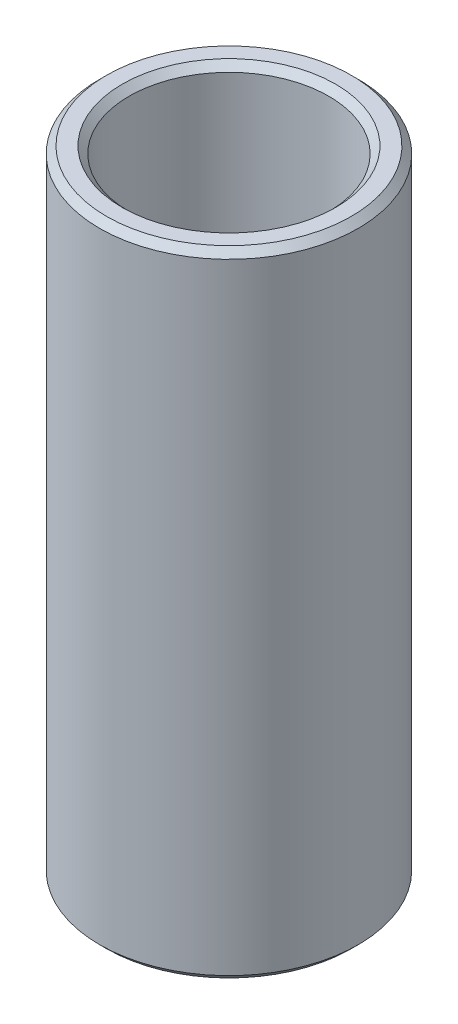
ISO-10303-21;
HEADER;
FILE_DESCRIPTION(('STEP AP214'),'2;1');
FILE_NAME('part.step','',(''),(''),'','','');
FILE_SCHEMA(('AUTOMOTIVE_DESIGN { 1 0 10303 214 1 1 1 1 }'));
ENDSEC;
DATA;
#1=APPLICATION_CONTEXT('core data for automotive mechanical design processes');
#2=APPLICATION_PROTOCOL_DEFINITION('international standard','automotive_design',2000,#1);
#3=PRODUCT_CONTEXT('',#1,'mechanical');
#4=PRODUCT('Part','Part','',(#3));
#5=PRODUCT_RELATED_PRODUCT_CATEGORY('part','',(#4));
#6=PRODUCT_DEFINITION_FORMATION('','',#4);
#7=PRODUCT_DEFINITION_CONTEXT('part definition',#1,'design');
#8=PRODUCT_DEFINITION('design','',#6,#7);
#9=PRODUCT_DEFINITION_SHAPE('','',#8);
#10=(LENGTH_UNIT() NAMED_UNIT(*) SI_UNIT(.MILLI.,.METRE.));
#11=(NAMED_UNIT(*) PLANE_ANGLE_UNIT() SI_UNIT($,.RADIAN.));
#12=(NAMED_UNIT(*) SI_UNIT($,.STERADIAN.) SOLID_ANGLE_UNIT());
#13=UNCERTAINTY_MEASURE_WITH_UNIT(LENGTH_MEASURE(1.E-05),#10,'distance_accuracy_value','');
#14=(GEOMETRIC_REPRESENTATION_CONTEXT(3) GLOBAL_UNCERTAINTY_ASSIGNED_CONTEXT((#13)) GLOBAL_UNIT_ASSIGNED_CONTEXT((#10,
#11,#12)) REPRESENTATION_CONTEXT('',''));
#15=CARTESIAN_POINT('',(0.,0.,0.));
#16=DIRECTION('',(0.,0.,1.));
#17=DIRECTION('',(1.,0.,0.));
#18=AXIS2_PLACEMENT_3D('',#15,#16,#17);
#19=CARTESIAN_POINT('',(0.,233.0522392291,0.));
#20=DIRECTION('',(0.,-1.,0.));
#21=DIRECTION('',(0.,0.,-1.));
#22=AXIS2_PLACEMENT_3D('',#19,#20,#21);
#23=CYLINDRICAL_SURFACE('',#22,47.5);
#24=CARTESIAN_POINT('',(0.,2.54671218478067,0.));
#25=DIRECTION('',(0.,1.,0.));
#26=DIRECTION('',(0.,0.,1.));
#27=AXIS2_PLACEMENT_3D('',#24,#25,#26);
#28=CIRCLE('',#27,47.5);
#29=CARTESIAN_POINT('',(0.,2.54671218478067,47.5));
#30=VERTEX_POINT('',#29);
#31=EDGE_CURVE('E10',#30,#30,#28,.T.);
#32=ORIENTED_EDGE('',*,*,#31,.T.);
#33=EDGE_LOOP('',(#32));
#34=FACE_BOUND('',#33,.T.);
#35=CARTESIAN_POINT('',(0.,230.50552704432,0.));
#36=DIRECTION('',(0.,1.,0.));
#37=DIRECTION('',(0.,0.,1.));
#38=AXIS2_PLACEMENT_3D('',#35,#36,#37);
#39=CIRCLE('',#38,47.5);
#40=CARTESIAN_POINT('',(0.,230.50552704432,47.5));
#41=VERTEX_POINT('',#40);
#42=EDGE_CURVE('E50',#41,#41,#39,.F.);
#43=ORIENTED_EDGE('',*,*,#42,.T.);
#44=EDGE_LOOP('',(#43));
#45=FACE_BOUND('',#44,.T.);
#46=ADVANCED_FACE('F39',(#34,#45),#23,.T.);
#47=CARTESIAN_POINT('',(0.,233.0522392291,0.));
#48=DIRECTION('',(0.,1.,0.));
#49=DIRECTION('',(0.,0.,1.));
#50=AXIS2_PLACEMENT_3D('',#47,#48,#49);
#51=PLANE('',#50);
#52=CARTESIAN_POINT('',(0.,233.0522392291,0.));
#53=DIRECTION('',(0.,1.,0.));
#54=DIRECTION('',(0.,0.,1.));
#55=AXIS2_PLACEMENT_3D('',#52,#53,#54);
#56=CIRCLE('',#55,39.2406115854343);
#57=CARTESIAN_POINT('',(0.,233.0522392291,39.2406115854343));
#58=VERTEX_POINT('',#57);
#59=EDGE_CURVE('E58',#58,#58,#56,.F.);
#60=ORIENTED_EDGE('',*,*,#59,.T.);
#61=EDGE_LOOP('',(#60));
#62=FACE_BOUND('',#61,.T.);
#63=CARTESIAN_POINT('',(0.,233.0522392291,0.));
#64=DIRECTION('',(0.,1.,0.));
#65=DIRECTION('',(0.,0.,1.));
#66=AXIS2_PLACEMENT_3D('',#63,#64,#65);
#67=CIRCLE('',#66,44.9532878152193);
#68=CARTESIAN_POINT('',(0.,233.0522392291,44.9532878152193));
#69=VERTEX_POINT('',#68);
#70=EDGE_CURVE('E61',#69,#69,#67,.T.);
#71=ORIENTED_EDGE('',*,*,#70,.T.);
#72=EDGE_LOOP('',(#71));
#73=FACE_BOUND('',#72,.T.);
#74=ADVANCED_FACE('F88',(#62,#73),#51,.T.);
#75=CARTESIAN_POINT('',(0.,0.,0.));
#76=DIRECTION('',(0.,1.,0.));
#77=DIRECTION('',(0.,0.,1.));
#78=AXIS2_PLACEMENT_3D('',#75,#76,#77);
#79=PLANE('',#78);
#80=CARTESIAN_POINT('',(0.,0.,0.));
#81=DIRECTION('',(0.,1.,0.));
#82=DIRECTION('',(0.,0.,1.));
#83=AXIS2_PLACEMENT_3D('',#80,#81,#82);
#84=CIRCLE('',#83,39.2406115854343);
#85=CARTESIAN_POINT('',(0.,0.,39.2406115854343));
#86=VERTEX_POINT('',#85);
#87=EDGE_CURVE('E51',#86,#86,#84,.T.);
#88=ORIENTED_EDGE('',*,*,#87,.T.);
#89=EDGE_LOOP('',(#88));
#90=FACE_BOUND('',#89,.T.);
#91=CARTESIAN_POINT('',(0.,0.,0.));
#92=DIRECTION('',(0.,1.,0.));
#93=DIRECTION('',(0.,0.,1.));
#94=AXIS2_PLACEMENT_3D('',#91,#92,#93);
#95=CIRCLE('',#94,44.9532878152193);
#96=CARTESIAN_POINT('',(0.,0.,44.9532878152193));
#97=VERTEX_POINT('',#96);
#98=EDGE_CURVE('E54',#97,#97,#95,.F.);
#99=ORIENTED_EDGE('',*,*,#98,.T.);
#100=EDGE_LOOP('',(#99));
#101=FACE_BOUND('',#100,.T.);
#102=ADVANCED_FACE('F83',(#90,#101),#79,.F.);
#103=CARTESIAN_POINT('',(0.,233.0522392291,0.));
#104=DIRECTION('',(0.,-1.,0.));
#105=DIRECTION('',(0.,0.,-1.));
#106=AXIS2_PLACEMENT_3D('',#103,#104,#105);
#107=CYLINDRICAL_SURFACE('',#106,36.6938994006536);
#108=CARTESIAN_POINT('',(0.,230.50552704432,0.));
#109=DIRECTION('',(0.,1.,0.));
#110=DIRECTION('',(0.,0.,1.));
#111=AXIS2_PLACEMENT_3D('',#108,#109,#110);
#112=CIRCLE('',#111,36.6938994006536);
#113=CARTESIAN_POINT('',(0.,230.50552704432,36.6938994006536));
#114=VERTEX_POINT('',#113);
#115=EDGE_CURVE('E67',#114,#114,#112,.T.);
#116=ORIENTED_EDGE('',*,*,#115,.T.);
#117=EDGE_LOOP('',(#116));
#118=FACE_BOUND('',#117,.T.);
#119=CARTESIAN_POINT('',(0.,2.54671218478067,0.));
#120=DIRECTION('',(0.,1.,0.));
#121=DIRECTION('',(0.,0.,1.));
#122=AXIS2_PLACEMENT_3D('',#119,#120,#121);
#123=CIRCLE('',#122,36.6938994006536);
#124=CARTESIAN_POINT('',(0.,2.54671218478067,36.6938994006536));
#125=VERTEX_POINT('',#124);
#126=EDGE_CURVE('E69',#125,#125,#123,.F.);
#127=ORIENTED_EDGE('',*,*,#126,.T.);
#128=EDGE_LOOP('',(#127));
#129=FACE_BOUND('',#128,.T.);
#130=ADVANCED_FACE('F71',(#118,#129),#107,.F.);
#131=CARTESIAN_POINT('',(0.,230.50552704432,0.));
#132=DIRECTION('',(0.,1.,0.));
#133=DIRECTION('',(0.,0.,1.));
#134=AXIS2_PLACEMENT_3D('',#131,#132,#133);
#135=CONICAL_SURFACE('',#134,36.6938994006536,0.78539816339745);
#136=ORIENTED_EDGE('',*,*,#59,.F.);
#137=EDGE_LOOP('',(#136));
#138=FACE_BOUND('',#137,.T.);
#139=ORIENTED_EDGE('',*,*,#115,.F.);
#140=EDGE_LOOP('',(#139));
#141=FACE_BOUND('',#140,.T.);
#142=ADVANCED_FACE('F77',(#138,#141),#135,.F.);
#143=CARTESIAN_POINT('',(0.,0.,0.));
#144=DIRECTION('',(0.,-1.,0.));
#145=DIRECTION('',(0.,0.,-1.));
#146=AXIS2_PLACEMENT_3D('',#143,#144,#145);
#147=CONICAL_SURFACE('',#146,39.2406115854343,0.78539816339745);
#148=ORIENTED_EDGE('',*,*,#126,.F.);
#149=EDGE_LOOP('',(#148));
#150=FACE_BOUND('',#149,.T.);
#151=ORIENTED_EDGE('',*,*,#87,.F.);
#152=EDGE_LOOP('',(#151));
#153=FACE_BOUND('',#152,.T.);
#154=ADVANCED_FACE('F73',(#150,#153),#147,.F.);
#155=CARTESIAN_POINT('',(0.,2.54671218478067,0.));
#156=DIRECTION('',(0.,1.,0.));
#157=DIRECTION('',(0.,0.,1.));
#158=AXIS2_PLACEMENT_3D('',#155,#156,#157);
#159=CONICAL_SURFACE('',#158,47.5,0.785398163397447);
#160=ORIENTED_EDGE('',*,*,#98,.F.);
#161=EDGE_LOOP('',(#160));
#162=FACE_BOUND('',#161,.T.);
#163=ORIENTED_EDGE('',*,*,#31,.F.);
#164=EDGE_LOOP('',(#163));
#165=FACE_BOUND('',#164,.T.);
#166=ADVANCED_FACE('F76',(#162,#165),#159,.T.);
#167=CARTESIAN_POINT('',(0.,233.0522392291,0.));
#168=DIRECTION('',(0.,-1.,0.));
#169=DIRECTION('',(0.,0.,-1.));
#170=AXIS2_PLACEMENT_3D('',#167,#168,#169);
#171=CONICAL_SURFACE('',#170,44.9532878152193,0.785398163397448);
#172=ORIENTED_EDGE('',*,*,#42,.F.);
#173=EDGE_LOOP('',(#172));
#174=FACE_BOUND('',#173,.T.);
#175=ORIENTED_EDGE('',*,*,#70,.F.);
#176=EDGE_LOOP('',(#175));
#177=FACE_BOUND('',#176,.T.);
#178=ADVANCED_FACE('F45',(#174,#177),#171,.T.);
#179=CLOSED_SHELL('',(#46,#74,#102,#130,#142,#154,#166,#178));
#180=MANIFOLD_SOLID_BREP('B2',#179);
#181=ADVANCED_BREP_SHAPE_REPRESENTATION('',(#18,#180),#14);
#182=SHAPE_DEFINITION_REPRESENTATION(#9,#181);
ENDSEC;
END-ISO-10303-21;
